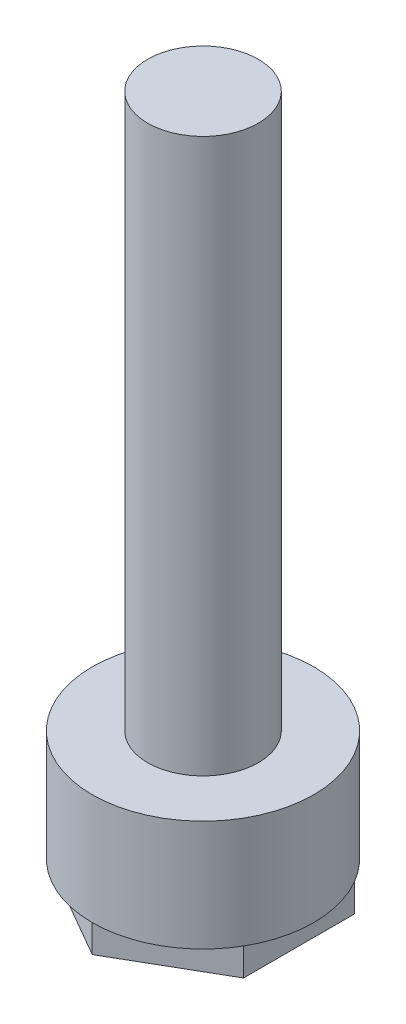
ISO-10303-21;
HEADER;
FILE_DESCRIPTION(('STEP AP214'),'2;1');
FILE_NAME('part.step','',(''),(''),'','','');
FILE_SCHEMA(('AUTOMOTIVE_DESIGN { 1 0 10303 214 1 1 1 1 }'));
ENDSEC;
DATA;
#1=APPLICATION_CONTEXT('core data for automotive mechanical design processes');
#2=APPLICATION_PROTOCOL_DEFINITION('international standard','automotive_design',2000,#1);
#3=PRODUCT_CONTEXT('',#1,'mechanical');
#4=PRODUCT('Part','Part','',(#3));
#5=PRODUCT_RELATED_PRODUCT_CATEGORY('part','',(#4));
#6=PRODUCT_DEFINITION_FORMATION('','',#4);
#7=PRODUCT_DEFINITION_CONTEXT('part definition',#1,'design');
#8=PRODUCT_DEFINITION('design','',#6,#7);
#9=PRODUCT_DEFINITION_SHAPE('','',#8);
#10=(LENGTH_UNIT() NAMED_UNIT(*) SI_UNIT(.MILLI.,.METRE.));
#11=(NAMED_UNIT(*) PLANE_ANGLE_UNIT() SI_UNIT($,.RADIAN.));
#12=(NAMED_UNIT(*) SI_UNIT($,.STERADIAN.) SOLID_ANGLE_UNIT());
#13=UNCERTAINTY_MEASURE_WITH_UNIT(LENGTH_MEASURE(1.E-05),#10,'distance_accuracy_value','');
#14=(GEOMETRIC_REPRESENTATION_CONTEXT(3) GLOBAL_UNCERTAINTY_ASSIGNED_CONTEXT((#13)) GLOBAL_UNIT_ASSIGNED_CONTEXT((#10,
#11,#12)) REPRESENTATION_CONTEXT('',''));
#15=CARTESIAN_POINT('',(0.,0.,0.));
#16=DIRECTION('',(0.,0.,1.));
#17=DIRECTION('',(1.,0.,0.));
#18=AXIS2_PLACEMENT_3D('',#15,#16,#17);
#19=CARTESIAN_POINT('',(0.,2.5,0.));
#20=DIRECTION('',(0.,-1.,0.));
#21=DIRECTION('',(0.,0.,-1.));
#22=AXIS2_PLACEMENT_3D('',#19,#20,#21);
#23=CYLINDRICAL_SURFACE('',#22,2.);
#24=CARTESIAN_POINT('',(0.,2.5,0.));
#25=DIRECTION('',(0.,1.,0.));
#26=DIRECTION('',(0.,0.,1.));
#27=AXIS2_PLACEMENT_3D('',#24,#25,#26);
#28=CIRCLE('',#27,2.);
#29=CARTESIAN_POINT('',(0.,2.5,2.));
#30=VERTEX_POINT('',#29);
#31=EDGE_CURVE('E12',#30,#30,#28,.T.);
#32=ORIENTED_EDGE('',*,*,#31,.F.);
#33=EDGE_LOOP('',(#32));
#34=FACE_BOUND('',#33,.T.);
#35=CARTESIAN_POINT('',(0.,0.5,0.));
#36=DIRECTION('',(0.,-1.,0.));
#37=DIRECTION('',(0.,0.,-1.));
#38=AXIS2_PLACEMENT_3D('',#35,#36,#37);
#39=CIRCLE('',#38,2.);
#40=CARTESIAN_POINT('',(1.73205080756887,0.5,1.00000000000002));
#41=VERTEX_POINT('',#40);
#42=CARTESIAN_POINT('',(0.,0.5,2.));
#43=VERTEX_POINT('',#42);
#44=EDGE_CURVE('E120',#41,#43,#39,.T.);
#45=ORIENTED_EDGE('',*,*,#44,.F.);
#46=CARTESIAN_POINT('',(0.,0.5,0.));
#47=DIRECTION('',(0.,-1.,0.));
#48=DIRECTION('',(0.,0.,-1.));
#49=AXIS2_PLACEMENT_3D('',#46,#47,#48);
#50=CIRCLE('',#49,2.);
#51=CARTESIAN_POINT('',(1.73205080756889,0.5,-0.999999999999984));
#52=VERTEX_POINT('',#51);
#53=EDGE_CURVE('E154',#52,#41,#50,.T.);
#54=ORIENTED_EDGE('',*,*,#53,.F.);
#55=CARTESIAN_POINT('',(0.,0.5,0.));
#56=DIRECTION('',(0.,-1.,0.));
#57=DIRECTION('',(0.,0.,-1.));
#58=AXIS2_PLACEMENT_3D('',#55,#56,#57);
#59=CIRCLE('',#58,2.);
#60=CARTESIAN_POINT('',(0.,0.5,-2.));
#61=VERTEX_POINT('',#60);
#62=EDGE_CURVE('E178',#61,#52,#59,.T.);
#63=ORIENTED_EDGE('',*,*,#62,.F.);
#64=CARTESIAN_POINT('',(0.,0.5,0.));
#65=DIRECTION('',(0.,-1.,0.));
#66=DIRECTION('',(0.,0.,-1.));
#67=AXIS2_PLACEMENT_3D('',#64,#65,#66);
#68=CIRCLE('',#67,2.);
#69=CARTESIAN_POINT('',(-1.73205080756887,0.5,-1.00000000000001));
#70=VERTEX_POINT('',#69);
#71=EDGE_CURVE('E186',#70,#61,#68,.T.);
#72=ORIENTED_EDGE('',*,*,#71,.F.);
#73=CARTESIAN_POINT('',(0.,0.5,0.));
#74=DIRECTION('',(0.,-1.,0.));
#75=DIRECTION('',(0.,0.,-1.));
#76=AXIS2_PLACEMENT_3D('',#73,#74,#75);
#77=CIRCLE('',#76,2.);
#78=CARTESIAN_POINT('',(-1.73205080756888,0.5,0.999999999999997));
#79=VERTEX_POINT('',#78);
#80=EDGE_CURVE('E193',#79,#70,#77,.T.);
#81=ORIENTED_EDGE('',*,*,#80,.F.);
#82=CARTESIAN_POINT('',(0.,0.5,0.));
#83=DIRECTION('',(0.,-1.,0.));
#84=DIRECTION('',(0.,0.,-1.));
#85=AXIS2_PLACEMENT_3D('',#82,#83,#84);
#86=CIRCLE('',#85,2.);
#87=EDGE_CURVE('E111',#43,#79,#86,.T.);
#88=ORIENTED_EDGE('',*,*,#87,.F.);
#89=EDGE_LOOP('',(#45,#54,#63,#72,#81,#88));
#90=FACE_BOUND('',#89,.T.);
#91=ADVANCED_FACE('F46',(#34,#90),#23,.T.);
#92=CARTESIAN_POINT('',(0.,0.,0.));
#93=DIRECTION('',(0.,1.,0.));
#94=DIRECTION('',(0.,0.,1.));
#95=AXIS2_PLACEMENT_3D('',#92,#93,#94);
#96=PLANE('',#95);
#97=DIRECTION('',(-0.866025403784442,0.,0.499999999999995));
#98=VECTOR('',#97,1.);
#99=CARTESIAN_POINT('',(0.866025403784433,0.,1.50000000000001));
#100=LINE('',#99,#98);
#101=CARTESIAN_POINT('',(1.73205080756887,0.,1.00000000000002));
#102=VERTEX_POINT('',#101);
#103=CARTESIAN_POINT('',(0.,0.,2.));
#104=VERTEX_POINT('',#103);
#105=EDGE_CURVE('E101',#102,#104,#100,.T.);
#106=ORIENTED_EDGE('',*,*,#105,.T.);
#107=DIRECTION('',(-0.866025403784438,0.,-0.500000000000001));
#108=VECTOR('',#107,1.);
#109=CARTESIAN_POINT('',(-0.86602540378444,0.,1.5));
#110=LINE('',#109,#108);
#111=CARTESIAN_POINT('',(-1.73205080756888,0.,0.999999999999997));
#112=VERTEX_POINT('',#111);
#113=EDGE_CURVE('E117',#104,#112,#110,.T.);
#114=ORIENTED_EDGE('',*,*,#113,.T.);
#115=DIRECTION('',(0.,0.,-1.));
#116=VECTOR('',#115,1.);
#117=CARTESIAN_POINT('',(-1.73205080756888,0.,0.));
#118=LINE('',#117,#116);
#119=CARTESIAN_POINT('',(-1.73205080756887,0.,-1.00000000000001));
#120=VERTEX_POINT('',#119);
#121=EDGE_CURVE('E60',#112,#120,#118,.T.);
#122=ORIENTED_EDGE('',*,*,#121,.T.);
#123=DIRECTION('',(0.866025403784442,0.,-0.499999999999995));
#124=VECTOR('',#123,1.);
#125=CARTESIAN_POINT('',(-0.866025403784429,0.,-1.5));
#126=LINE('',#125,#124);
#127=CARTESIAN_POINT('',(0.,0.,-2.));
#128=VERTEX_POINT('',#127);
#129=EDGE_CURVE('E69',#120,#128,#126,.T.);
#130=ORIENTED_EDGE('',*,*,#129,.T.);
#131=DIRECTION('',(0.866025403784435,0.,0.500000000000007));
#132=VECTOR('',#131,1.);
#133=CARTESIAN_POINT('',(0.86602540378445,0.,-1.49999999999999));
#134=LINE('',#133,#132);
#135=CARTESIAN_POINT('',(1.73205080756889,0.,-0.999999999999984));
#136=VERTEX_POINT('',#135);
#137=EDGE_CURVE('E171',#128,#136,#134,.T.);
#138=ORIENTED_EDGE('',*,*,#137,.T.);
#139=DIRECTION('',(0.,0.,1.));
#140=VECTOR('',#139,1.);
#141=CARTESIAN_POINT('',(1.73205080756888,0.,0.));
#142=LINE('',#141,#140);
#143=EDGE_CURVE('E119',#136,#102,#142,.T.);
#144=ORIENTED_EDGE('',*,*,#143,.T.);
#145=EDGE_LOOP('',(#106,#114,#122,#130,#138,#144));
#146=FACE_BOUND('',#145,.T.);
#147=ADVANCED_FACE('F116',(#146),#96,.F.);
#148=CARTESIAN_POINT('',(0.,2.5,0.));
#149=DIRECTION('',(0.,1.,0.));
#150=DIRECTION('',(0.,0.,1.));
#151=AXIS2_PLACEMENT_3D('',#148,#149,#150);
#152=PLANE('',#151);
#153=CARTESIAN_POINT('',(0.,2.5,0.));
#154=DIRECTION('',(0.,1.,0.));
#155=DIRECTION('',(0.,0.,1.));
#156=AXIS2_PLACEMENT_3D('',#153,#154,#155);
#157=CIRCLE('',#156,1.);
#158=CARTESIAN_POINT('',(0.,2.5,1.));
#159=VERTEX_POINT('',#158);
#160=EDGE_CURVE('E132',#159,#159,#157,.T.);
#161=ORIENTED_EDGE('',*,*,#160,.F.);
#162=EDGE_LOOP('',(#161));
#163=FACE_BOUND('',#162,.T.);
#164=ORIENTED_EDGE('',*,*,#31,.T.);
#165=EDGE_LOOP('',(#164));
#166=FACE_BOUND('',#165,.T.);
#167=ADVANCED_FACE('F140',(#163,#166),#152,.T.);
#168=CARTESIAN_POINT('',(0.,12.5,0.));
#169=DIRECTION('',(0.,-1.,0.));
#170=DIRECTION('',(0.,0.,-1.));
#171=AXIS2_PLACEMENT_3D('',#168,#169,#170);
#172=CYLINDRICAL_SURFACE('',#171,1.);
#173=CARTESIAN_POINT('',(0.,12.5,0.));
#174=DIRECTION('',(0.,1.,0.));
#175=DIRECTION('',(0.,0.,1.));
#176=AXIS2_PLACEMENT_3D('',#173,#174,#175);
#177=CIRCLE('',#176,1.);
#178=CARTESIAN_POINT('',(0.,12.5,1.));
#179=VERTEX_POINT('',#178);
#180=EDGE_CURVE('E53',#179,#179,#177,.T.);
#181=ORIENTED_EDGE('',*,*,#180,.F.);
#182=EDGE_LOOP('',(#181));
#183=FACE_BOUND('',#182,.T.);
#184=ORIENTED_EDGE('',*,*,#160,.T.);
#185=EDGE_LOOP('',(#184));
#186=FACE_BOUND('',#185,.T.);
#187=ADVANCED_FACE('F138',(#183,#186),#172,.T.);
#188=CARTESIAN_POINT('',(0.,12.5,0.));
#189=DIRECTION('',(0.,1.,0.));
#190=DIRECTION('',(0.,0.,1.));
#191=AXIS2_PLACEMENT_3D('',#188,#189,#190);
#192=PLANE('',#191);
#193=ORIENTED_EDGE('',*,*,#180,.T.);
#194=EDGE_LOOP('',(#193));
#195=FACE_BOUND('',#194,.T.);
#196=ADVANCED_FACE('F210',(#195),#192,.T.);
#197=CARTESIAN_POINT('',(-0.86602540378444,0.5,1.5));
#198=DIRECTION('',(-0.500000000000001,0.,0.866025403784438));
#199=DIRECTION('',(0.866025403784438,0.,0.500000000000001));
#200=AXIS2_PLACEMENT_3D('',#197,#198,#199);
#201=PLANE('',#200);
#202=ORIENTED_EDGE('',*,*,#113,.F.);
#203=DIRECTION('',(0.,-1.,0.));
#204=VECTOR('',#203,1.);
#205=CARTESIAN_POINT('',(0.,0.5,2.));
#206=LINE('',#205,#204);
#207=EDGE_CURVE('E98',#43,#104,#206,.T.);
#208=ORIENTED_EDGE('',*,*,#207,.F.);
#209=DIRECTION('',(-0.866025403784438,0.,-0.500000000000001));
#210=VECTOR('',#209,1.);
#211=CARTESIAN_POINT('',(-0.86602540378444,0.5,1.5));
#212=LINE('',#211,#210);
#213=EDGE_CURVE('E123',#43,#79,#212,.T.);
#214=ORIENTED_EDGE('',*,*,#213,.T.);
#215=DIRECTION('',(0.,-1.,0.));
#216=VECTOR('',#215,1.);
#217=CARTESIAN_POINT('',(-1.73205080756888,0.5,0.999999999999997));
#218=LINE('',#217,#216);
#219=EDGE_CURVE('E110',#79,#112,#218,.T.);
#220=ORIENTED_EDGE('',*,*,#219,.T.);
#221=EDGE_LOOP('',(#202,#208,#214,#220));
#222=FACE_BOUND('',#221,.T.);
#223=ADVANCED_FACE('F122',(#222),#201,.T.);
#224=CARTESIAN_POINT('',(0.,0.5,0.));
#225=DIRECTION('',(0.,-1.,0.));
#226=DIRECTION('',(0.,0.,-1.));
#227=AXIS2_PLACEMENT_3D('',#224,#225,#226);
#228=PLANE('',#227);
#229=ORIENTED_EDGE('',*,*,#213,.F.);
#230=ORIENTED_EDGE('',*,*,#87,.T.);
#231=EDGE_LOOP('',(#229,#230));
#232=FACE_BOUND('',#231,.T.);
#233=ADVANCED_FACE('F201',(#232),#228,.T.);
#234=CARTESIAN_POINT('',(-1.73205080756888,0.5,0.));
#235=DIRECTION('',(-1.,0.,0.));
#236=DIRECTION('',(0.,0.,1.));
#237=AXIS2_PLACEMENT_3D('',#234,#235,#236);
#238=PLANE('',#237);
#239=ORIENTED_EDGE('',*,*,#121,.F.);
#240=ORIENTED_EDGE('',*,*,#219,.F.);
#241=DIRECTION('',(0.,0.,-1.));
#242=VECTOR('',#241,1.);
#243=CARTESIAN_POINT('',(-1.73205080756888,0.5,0.));
#244=LINE('',#243,#242);
#245=EDGE_CURVE('E124',#79,#70,#244,.T.);
#246=ORIENTED_EDGE('',*,*,#245,.T.);
#247=DIRECTION('',(0.,-1.,0.));
#248=VECTOR('',#247,1.);
#249=CARTESIAN_POINT('',(-1.73205080756887,0.5,-1.00000000000001));
#250=LINE('',#249,#248);
#251=EDGE_CURVE('E128',#70,#120,#250,.T.);
#252=ORIENTED_EDGE('',*,*,#251,.T.);
#253=EDGE_LOOP('',(#239,#240,#246,#252));
#254=FACE_BOUND('',#253,.T.);
#255=ADVANCED_FACE('F203',(#254),#238,.T.);
#256=CARTESIAN_POINT('',(0.,0.5,0.));
#257=DIRECTION('',(0.,-1.,0.));
#258=DIRECTION('',(0.,0.,-1.));
#259=AXIS2_PLACEMENT_3D('',#256,#257,#258);
#260=PLANE('',#259);
#261=ORIENTED_EDGE('',*,*,#245,.F.);
#262=ORIENTED_EDGE('',*,*,#80,.T.);
#263=EDGE_LOOP('',(#261,#262));
#264=FACE_BOUND('',#263,.T.);
#265=ADVANCED_FACE('F198',(#264),#260,.T.);
#266=CARTESIAN_POINT('',(-0.866025403784429,0.5,-1.5));
#267=DIRECTION('',(-0.499999999999995,0.,-0.866025403784442));
#268=DIRECTION('',(-0.866025403784442,0.,0.499999999999995));
#269=AXIS2_PLACEMENT_3D('',#266,#267,#268);
#270=PLANE('',#269);
#271=ORIENTED_EDGE('',*,*,#129,.F.);
#272=ORIENTED_EDGE('',*,*,#251,.F.);
#273=DIRECTION('',(0.866025403784442,0.,-0.499999999999995));
#274=VECTOR('',#273,1.);
#275=CARTESIAN_POINT('',(-0.866025403784429,0.5,-1.5));
#276=LINE('',#275,#274);
#277=EDGE_CURVE('E183',#70,#61,#276,.T.);
#278=ORIENTED_EDGE('',*,*,#277,.T.);
#279=DIRECTION('',(0.,-1.,0.));
#280=VECTOR('',#279,1.);
#281=CARTESIAN_POINT('',(0.,0.5,-2.));
#282=LINE('',#281,#280);
#283=EDGE_CURVE('E189',#61,#128,#282,.T.);
#284=ORIENTED_EDGE('',*,*,#283,.T.);
#285=EDGE_LOOP('',(#271,#272,#278,#284));
#286=FACE_BOUND('',#285,.T.);
#287=ADVANCED_FACE('F264',(#286),#270,.T.);
#288=CARTESIAN_POINT('',(0.,0.5,0.));
#289=DIRECTION('',(0.,-1.,0.));
#290=DIRECTION('',(0.,0.,-1.));
#291=AXIS2_PLACEMENT_3D('',#288,#289,#290);
#292=PLANE('',#291);
#293=ORIENTED_EDGE('',*,*,#277,.F.);
#294=ORIENTED_EDGE('',*,*,#71,.T.);
#295=EDGE_LOOP('',(#293,#294));
#296=FACE_BOUND('',#295,.T.);
#297=ADVANCED_FACE('F273',(#296),#292,.T.);
#298=CARTESIAN_POINT('',(0.86602540378445,0.5,-1.49999999999999));
#299=DIRECTION('',(0.500000000000007,0.,-0.866025403784435));
#300=DIRECTION('',(-0.866025403784435,0.,-0.500000000000007));
#301=AXIS2_PLACEMENT_3D('',#298,#299,#300);
#302=PLANE('',#301);
#303=ORIENTED_EDGE('',*,*,#137,.F.);
#304=ORIENTED_EDGE('',*,*,#283,.F.);
#305=DIRECTION('',(0.866025403784435,0.,0.500000000000007));
#306=VECTOR('',#305,1.);
#307=CARTESIAN_POINT('',(0.86602540378445,0.5,-1.49999999999999));
#308=LINE('',#307,#306);
#309=EDGE_CURVE('E176',#61,#52,#308,.T.);
#310=ORIENTED_EDGE('',*,*,#309,.T.);
#311=DIRECTION('',(0.,-1.,0.));
#312=VECTOR('',#311,1.);
#313=CARTESIAN_POINT('',(1.73205080756889,0.5,-0.999999999999984));
#314=LINE('',#313,#312);
#315=EDGE_CURVE('E166',#52,#136,#314,.T.);
#316=ORIENTED_EDGE('',*,*,#315,.T.);
#317=EDGE_LOOP('',(#303,#304,#310,#316));
#318=FACE_BOUND('',#317,.T.);
#319=ADVANCED_FACE('F282',(#318),#302,.T.);
#320=CARTESIAN_POINT('',(0.,0.5,0.));
#321=DIRECTION('',(0.,-1.,0.));
#322=DIRECTION('',(0.,0.,-1.));
#323=AXIS2_PLACEMENT_3D('',#320,#321,#322);
#324=PLANE('',#323);
#325=ORIENTED_EDGE('',*,*,#309,.F.);
#326=ORIENTED_EDGE('',*,*,#62,.T.);
#327=EDGE_LOOP('',(#325,#326));
#328=FACE_BOUND('',#327,.T.);
#329=ADVANCED_FACE('F293',(#328),#324,.T.);
#330=CARTESIAN_POINT('',(1.73205080756888,0.5,0.));
#331=DIRECTION('',(1.,0.,0.));
#332=DIRECTION('',(0.,0.,-1.));
#333=AXIS2_PLACEMENT_3D('',#330,#331,#332);
#334=PLANE('',#333);
#335=ORIENTED_EDGE('',*,*,#143,.F.);
#336=ORIENTED_EDGE('',*,*,#315,.F.);
#337=DIRECTION('',(0.,0.,1.));
#338=VECTOR('',#337,1.);
#339=CARTESIAN_POINT('',(1.73205080756888,0.5,0.));
#340=LINE('',#339,#338);
#341=EDGE_CURVE('E162',#52,#41,#340,.T.);
#342=ORIENTED_EDGE('',*,*,#341,.T.);
#343=DIRECTION('',(0.,-1.,0.));
#344=VECTOR('',#343,1.);
#345=CARTESIAN_POINT('',(1.73205080756887,0.5,1.00000000000002));
#346=LINE('',#345,#344);
#347=EDGE_CURVE('E164',#41,#102,#346,.T.);
#348=ORIENTED_EDGE('',*,*,#347,.T.);
#349=EDGE_LOOP('',(#335,#336,#342,#348));
#350=FACE_BOUND('',#349,.T.);
#351=ADVANCED_FACE('F163',(#350),#334,.T.);
#352=CARTESIAN_POINT('',(0.,0.5,0.));
#353=DIRECTION('',(0.,-1.,0.));
#354=DIRECTION('',(0.,0.,-1.));
#355=AXIS2_PLACEMENT_3D('',#352,#353,#354);
#356=PLANE('',#355);
#357=ORIENTED_EDGE('',*,*,#341,.F.);
#358=ORIENTED_EDGE('',*,*,#53,.T.);
#359=EDGE_LOOP('',(#357,#358));
#360=FACE_BOUND('',#359,.T.);
#361=ADVANCED_FACE('F169',(#360),#356,.T.);
#362=CARTESIAN_POINT('',(0.866025403784433,0.5,1.50000000000001));
#363=DIRECTION('',(0.499999999999995,0.,0.866025403784442));
#364=DIRECTION('',(0.866025403784442,0.,-0.499999999999995));
#365=AXIS2_PLACEMENT_3D('',#362,#363,#364);
#366=PLANE('',#365);
#367=ORIENTED_EDGE('',*,*,#105,.F.);
#368=ORIENTED_EDGE('',*,*,#347,.F.);
#369=DIRECTION('',(-0.866025403784442,0.,0.499999999999995));
#370=VECTOR('',#369,1.);
#371=CARTESIAN_POINT('',(0.866025403784433,0.5,1.50000000000001));
#372=LINE('',#371,#370);
#373=EDGE_CURVE('E104',#41,#43,#372,.T.);
#374=ORIENTED_EDGE('',*,*,#373,.T.);
#375=ORIENTED_EDGE('',*,*,#207,.T.);
#376=EDGE_LOOP('',(#367,#368,#374,#375));
#377=FACE_BOUND('',#376,.T.);
#378=ADVANCED_FACE('F100',(#377),#366,.T.);
#379=CARTESIAN_POINT('',(0.,0.5,0.));
#380=DIRECTION('',(0.,-1.,0.));
#381=DIRECTION('',(0.,0.,-1.));
#382=AXIS2_PLACEMENT_3D('',#379,#380,#381);
#383=PLANE('',#382);
#384=ORIENTED_EDGE('',*,*,#373,.F.);
#385=ORIENTED_EDGE('',*,*,#44,.T.);
#386=EDGE_LOOP('',(#384,#385));
#387=FACE_BOUND('',#386,.T.);
#388=ADVANCED_FACE('F330',(#387),#383,.T.);
#389=CLOSED_SHELL('',(#91,#147,#167,#187,#196,#223,#233,#255,#265,#287,#297,#319,#329,#351,#361,
#378,#388));
#390=MANIFOLD_SOLID_BREP('B2',#389);
#391=ADVANCED_BREP_SHAPE_REPRESENTATION('',(#18,#390),#14);
#392=SHAPE_DEFINITION_REPRESENTATION(#9,#391);
ENDSEC;
END-ISO-10303-21;
